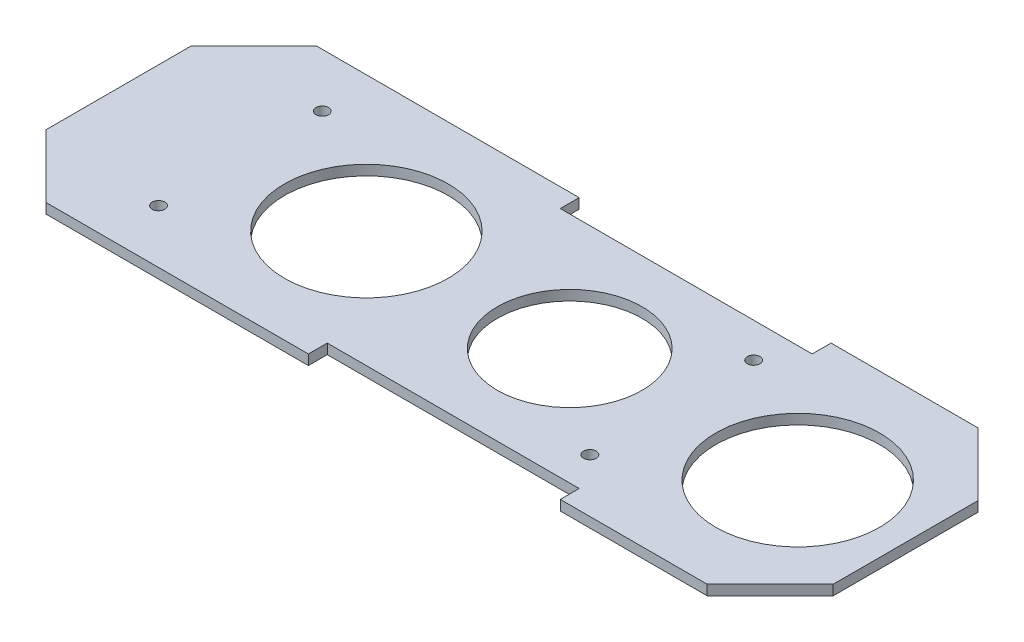
ISO-10303-21;
HEADER;
FILE_DESCRIPTION(('STEP AP214'),'2;1');
FILE_NAME('part.step','',(''),(''),'','','');
FILE_SCHEMA(('AUTOMOTIVE_DESIGN { 1 0 10303 214 1 1 1 1 }'));
ENDSEC;
DATA;
#1=APPLICATION_CONTEXT('core data for automotive mechanical design processes');
#2=APPLICATION_PROTOCOL_DEFINITION('international standard','automotive_design',2000,#1);
#3=PRODUCT_CONTEXT('',#1,'mechanical');
#4=PRODUCT('Part','Part','',(#3));
#5=PRODUCT_RELATED_PRODUCT_CATEGORY('part','',(#4));
#6=PRODUCT_DEFINITION_FORMATION('','',#4);
#7=PRODUCT_DEFINITION_CONTEXT('part definition',#1,'design');
#8=PRODUCT_DEFINITION('design','',#6,#7);
#9=PRODUCT_DEFINITION_SHAPE('','',#8);
#10=(LENGTH_UNIT() NAMED_UNIT(*) SI_UNIT(.MILLI.,.METRE.));
#11=(NAMED_UNIT(*) PLANE_ANGLE_UNIT() SI_UNIT($,.RADIAN.));
#12=(NAMED_UNIT(*) SI_UNIT($,.STERADIAN.) SOLID_ANGLE_UNIT());
#13=UNCERTAINTY_MEASURE_WITH_UNIT(LENGTH_MEASURE(1.E-05),#10,'distance_accuracy_value','');
#14=(GEOMETRIC_REPRESENTATION_CONTEXT(3) GLOBAL_UNCERTAINTY_ASSIGNED_CONTEXT((#13)) GLOBAL_UNIT_ASSIGNED_CONTEXT((#10,
#11,#12)) REPRESENTATION_CONTEXT('',''));
#15=CARTESIAN_POINT('',(0.,0.,0.));
#16=DIRECTION('',(0.,0.,1.));
#17=DIRECTION('',(1.,0.,0.));
#18=AXIS2_PLACEMENT_3D('',#15,#16,#17);
#19=CARTESIAN_POINT('',(91.6666666666666,1.6,0.));
#20=DIRECTION('',(-1.,0.,0.));
#21=DIRECTION('',(0.,0.,1.));
#22=AXIS2_PLACEMENT_3D('',#19,#20,#21);
#23=PLANE('',#22);
#24=DIRECTION('',(0.,0.,-1.));
#25=VECTOR('',#24,1.);
#26=CARTESIAN_POINT('',(91.6666666666666,0.,0.));
#27=LINE('',#26,#25);
#28=CARTESIAN_POINT('',(91.6666666666666,0.,21.5));
#29=VERTEX_POINT('',#28);
#30=CARTESIAN_POINT('',(91.6666666666666,0.,18.5));
#31=VERTEX_POINT('',#30);
#32=EDGE_CURVE('E162',#29,#31,#27,.T.);
#33=ORIENTED_EDGE('',*,*,#32,.F.);
#34=DIRECTION('',(0.,-1.,0.));
#35=VECTOR('',#34,1.);
#36=CARTESIAN_POINT('',(91.6666666666666,1.6,21.5));
#37=LINE('',#36,#35);
#38=CARTESIAN_POINT('',(91.6666666666666,1.6,21.5));
#39=VERTEX_POINT('',#38);
#40=EDGE_CURVE('E157',#39,#29,#37,.T.);
#41=ORIENTED_EDGE('',*,*,#40,.F.);
#42=DIRECTION('',(0.,0.,-1.));
#43=VECTOR('',#42,1.);
#44=CARTESIAN_POINT('',(91.6666666666666,1.6,0.));
#45=LINE('',#44,#43);
#46=CARTESIAN_POINT('',(91.6666666666666,1.6,18.5));
#47=VERTEX_POINT('',#46);
#48=EDGE_CURVE('E160',#39,#47,#45,.T.);
#49=ORIENTED_EDGE('',*,*,#48,.T.);
#50=DIRECTION('',(0.,-1.,0.));
#51=VECTOR('',#50,1.);
#52=CARTESIAN_POINT('',(91.6666666666666,1.6,18.5));
#53=LINE('',#52,#51);
#54=EDGE_CURVE('E230',#47,#31,#53,.T.);
#55=ORIENTED_EDGE('',*,*,#54,.T.);
#56=EDGE_LOOP('',(#33,#41,#49,#55));
#57=FACE_BOUND('',#56,.T.);
#58=ADVANCED_FACE('F42',(#57),#23,.T.);
#59=CARTESIAN_POINT('',(0.,1.6,21.5000000000002));
#60=DIRECTION('',(0.,0.,-1.));
#61=DIRECTION('',(-1.,0.,0.));
#62=AXIS2_PLACEMENT_3D('',#59,#60,#61);
#63=PLANE('',#62);
#64=DIRECTION('',(1.,0.,0.));
#65=VECTOR('',#64,1.);
#66=CARTESIAN_POINT('',(0.,0.,21.5000000000002));
#67=LINE('',#66,#65);
#68=CARTESIAN_POINT('',(115.,0.,21.4999999999999));
#69=VERTEX_POINT('',#68);
#70=EDGE_CURVE('E257',#29,#69,#67,.T.);
#71=ORIENTED_EDGE('',*,*,#70,.T.);
#72=DIRECTION('',(0.,1.,0.));
#73=VECTOR('',#72,1.);
#74=CARTESIAN_POINT('',(115.,1.6,21.4999999999999));
#75=LINE('',#74,#73);
#76=CARTESIAN_POINT('',(115.,1.6,21.4999999999999));
#77=VERTEX_POINT('',#76);
#78=EDGE_CURVE('E174',#69,#77,#75,.T.);
#79=ORIENTED_EDGE('',*,*,#78,.T.);
#80=DIRECTION('',(1.,0.,0.));
#81=VECTOR('',#80,1.);
#82=CARTESIAN_POINT('',(0.,1.6,21.5000000000002));
#83=LINE('',#82,#81);
#84=EDGE_CURVE('E171',#39,#77,#83,.T.);
#85=ORIENTED_EDGE('',*,*,#84,.F.);
#86=ORIENTED_EDGE('',*,*,#40,.T.);
#87=EDGE_LOOP('',(#71,#79,#85,#86));
#88=FACE_BOUND('',#87,.T.);
#89=ADVANCED_FACE('F172',(#88),#63,.F.);
#90=CARTESIAN_POINT('',(125.,1.6,0.));
#91=DIRECTION('',(1.,0.,0.));
#92=DIRECTION('',(0.,0.,-1.));
#93=AXIS2_PLACEMENT_3D('',#90,#91,#92);
#94=PLANE('',#93);
#95=DIRECTION('',(0.,0.,1.));
#96=VECTOR('',#95,1.);
#97=CARTESIAN_POINT('',(125.,0.,0.));
#98=LINE('',#97,#96);
#99=CARTESIAN_POINT('',(125.,0.,-11.4999999999999));
#100=VERTEX_POINT('',#99);
#101=CARTESIAN_POINT('',(125.,0.,11.4999999999999));
#102=VERTEX_POINT('',#101);
#103=EDGE_CURVE('E260',#100,#102,#98,.T.);
#104=ORIENTED_EDGE('',*,*,#103,.F.);
#105=DIRECTION('',(0.,1.,0.));
#106=VECTOR('',#105,1.);
#107=CARTESIAN_POINT('',(125.,1.6,-11.4999999999999));
#108=LINE('',#107,#106);
#109=CARTESIAN_POINT('',(125.,1.6,-11.4999999999999));
#110=VERTEX_POINT('',#109);
#111=EDGE_CURVE('E343',#100,#110,#108,.T.);
#112=ORIENTED_EDGE('',*,*,#111,.T.);
#113=DIRECTION('',(0.,0.,1.));
#114=VECTOR('',#113,1.);
#115=CARTESIAN_POINT('',(125.,1.6,0.));
#116=LINE('',#115,#114);
#117=CARTESIAN_POINT('',(125.,1.6,11.4999999999999));
#118=VERTEX_POINT('',#117);
#119=EDGE_CURVE('E177',#110,#118,#116,.T.);
#120=ORIENTED_EDGE('',*,*,#119,.T.);
#121=DIRECTION('',(0.,-1.,0.));
#122=VECTOR('',#121,1.);
#123=CARTESIAN_POINT('',(125.,0.,11.4999999999999));
#124=LINE('',#123,#122);
#125=EDGE_CURVE('E339',#118,#102,#124,.T.);
#126=ORIENTED_EDGE('',*,*,#125,.T.);
#127=EDGE_LOOP('',(#104,#112,#120,#126));
#128=FACE_BOUND('',#127,.T.);
#129=ADVANCED_FACE('F396',(#128),#94,.T.);
#130=CARTESIAN_POINT('',(0.,1.6,-21.5));
#131=DIRECTION('',(0.,0.,-1.));
#132=DIRECTION('',(-1.,0.,0.));
#133=AXIS2_PLACEMENT_3D('',#130,#131,#132);
#134=PLANE('',#133);
#135=DIRECTION('',(1.,0.,0.));
#136=VECTOR('',#135,1.);
#137=CARTESIAN_POINT('',(0.,1.6,-21.5));
#138=LINE('',#137,#136);
#139=CARTESIAN_POINT('',(91.6666666666666,1.6,-21.5));
#140=VERTEX_POINT('',#139);
#141=CARTESIAN_POINT('',(115.,1.6,-21.5));
#142=VERTEX_POINT('',#141);
#143=EDGE_CURVE('E197',#140,#142,#138,.T.);
#144=ORIENTED_EDGE('',*,*,#143,.T.);
#145=DIRECTION('',(0.,-1.,0.));
#146=VECTOR('',#145,1.);
#147=CARTESIAN_POINT('',(115.,1.6,-21.5));
#148=LINE('',#147,#146);
#149=CARTESIAN_POINT('',(115.,0.,-21.5));
#150=VERTEX_POINT('',#149);
#151=EDGE_CURVE('E167',#142,#150,#148,.T.);
#152=ORIENTED_EDGE('',*,*,#151,.T.);
#153=DIRECTION('',(1.,0.,0.));
#154=VECTOR('',#153,1.);
#155=CARTESIAN_POINT('',(0.,0.,-21.5));
#156=LINE('',#155,#154);
#157=CARTESIAN_POINT('',(91.6666666666666,0.,-21.5));
#158=VERTEX_POINT('',#157);
#159=EDGE_CURVE('E264',#158,#150,#156,.T.);
#160=ORIENTED_EDGE('',*,*,#159,.F.);
#161=DIRECTION('',(0.,-1.,0.));
#162=VECTOR('',#161,1.);
#163=CARTESIAN_POINT('',(91.6666666666666,1.6,-21.5));
#164=LINE('',#163,#162);
#165=EDGE_CURVE('E168',#140,#158,#164,.T.);
#166=ORIENTED_EDGE('',*,*,#165,.F.);
#167=EDGE_LOOP('',(#144,#152,#160,#166));
#168=FACE_BOUND('',#167,.T.);
#169=ADVANCED_FACE('F403',(#168),#134,.T.);
#170=CARTESIAN_POINT('',(91.6666666666666,1.6,0.));
#171=DIRECTION('',(1.,0.,0.));
#172=DIRECTION('',(0.,0.,-1.));
#173=AXIS2_PLACEMENT_3D('',#170,#171,#172);
#174=PLANE('',#173);
#175=DIRECTION('',(0.,0.,1.));
#176=VECTOR('',#175,1.);
#177=CARTESIAN_POINT('',(91.6666666666666,0.,0.));
#178=LINE('',#177,#176);
#179=CARTESIAN_POINT('',(91.6666666666666,0.,-18.5));
#180=VERTEX_POINT('',#179);
#181=EDGE_CURVE('E268',#158,#180,#178,.T.);
#182=ORIENTED_EDGE('',*,*,#181,.T.);
#183=DIRECTION('',(0.,-1.,0.));
#184=VECTOR('',#183,1.);
#185=CARTESIAN_POINT('',(91.6666666666666,1.6,-18.5));
#186=LINE('',#185,#184);
#187=CARTESIAN_POINT('',(91.6666666666666,1.6,-18.5));
#188=VERTEX_POINT('',#187);
#189=EDGE_CURVE('E319',#188,#180,#186,.T.);
#190=ORIENTED_EDGE('',*,*,#189,.F.);
#191=DIRECTION('',(0.,0.,1.));
#192=VECTOR('',#191,1.);
#193=CARTESIAN_POINT('',(91.6666666666666,1.6,0.));
#194=LINE('',#193,#192);
#195=EDGE_CURVE('E201',#140,#188,#194,.T.);
#196=ORIENTED_EDGE('',*,*,#195,.F.);
#197=ORIENTED_EDGE('',*,*,#165,.T.);
#198=EDGE_LOOP('',(#182,#190,#196,#197));
#199=FACE_BOUND('',#198,.T.);
#200=ADVANCED_FACE('F409',(#199),#174,.F.);
#201=CARTESIAN_POINT('',(0.,1.6,-18.5));
#202=DIRECTION('',(0.,0.,-1.));
#203=DIRECTION('',(-1.,0.,0.));
#204=AXIS2_PLACEMENT_3D('',#201,#202,#203);
#205=PLANE('',#204);
#206=DIRECTION('',(1.,0.,0.));
#207=VECTOR('',#206,1.);
#208=CARTESIAN_POINT('',(0.,0.,-18.5));
#209=LINE('',#208,#207);
#210=CARTESIAN_POINT('',(51.6666666666666,0.,-18.5));
#211=VERTEX_POINT('',#210);
#212=EDGE_CURVE('E272',#211,#180,#209,.T.);
#213=ORIENTED_EDGE('',*,*,#212,.F.);
#214=DIRECTION('',(0.,-1.,0.));
#215=VECTOR('',#214,1.);
#216=CARTESIAN_POINT('',(51.6666666666666,1.6,-18.5));
#217=LINE('',#216,#215);
#218=CARTESIAN_POINT('',(51.6666666666666,1.6,-18.5));
#219=VERTEX_POINT('',#218);
#220=EDGE_CURVE('E316',#219,#211,#217,.T.);
#221=ORIENTED_EDGE('',*,*,#220,.F.);
#222=DIRECTION('',(1.,0.,0.));
#223=VECTOR('',#222,1.);
#224=CARTESIAN_POINT('',(0.,1.6,-18.5));
#225=LINE('',#224,#223);
#226=EDGE_CURVE('E204',#219,#188,#225,.T.);
#227=ORIENTED_EDGE('',*,*,#226,.T.);
#228=ORIENTED_EDGE('',*,*,#189,.T.);
#229=EDGE_LOOP('',(#213,#221,#227,#228));
#230=FACE_BOUND('',#229,.T.);
#231=ADVANCED_FACE('F631',(#230),#205,.T.);
#232=CARTESIAN_POINT('',(51.6666666666666,1.6,0.));
#233=DIRECTION('',(1.,0.,0.));
#234=DIRECTION('',(0.,0.,-1.));
#235=AXIS2_PLACEMENT_3D('',#232,#233,#234);
#236=PLANE('',#235);
#237=DIRECTION('',(0.,0.,1.));
#238=VECTOR('',#237,1.);
#239=CARTESIAN_POINT('',(51.6666666666666,0.,0.));
#240=LINE('',#239,#238);
#241=CARTESIAN_POINT('',(51.6666666666666,0.,-21.5));
#242=VERTEX_POINT('',#241);
#243=EDGE_CURVE('E276',#242,#211,#240,.T.);
#244=ORIENTED_EDGE('',*,*,#243,.F.);
#245=DIRECTION('',(0.,-1.,0.));
#246=VECTOR('',#245,1.);
#247=CARTESIAN_POINT('',(51.6666666666666,1.6,-21.5));
#248=LINE('',#247,#246);
#249=CARTESIAN_POINT('',(51.6666666666666,1.6,-21.5));
#250=VERTEX_POINT('',#249);
#251=EDGE_CURVE('E312',#250,#242,#248,.T.);
#252=ORIENTED_EDGE('',*,*,#251,.F.);
#253=DIRECTION('',(0.,0.,1.));
#254=VECTOR('',#253,1.);
#255=CARTESIAN_POINT('',(51.6666666666666,1.6,0.));
#256=LINE('',#255,#254);
#257=EDGE_CURVE('E208',#250,#219,#256,.T.);
#258=ORIENTED_EDGE('',*,*,#257,.T.);
#259=ORIENTED_EDGE('',*,*,#220,.T.);
#260=EDGE_LOOP('',(#244,#252,#258,#259));
#261=FACE_BOUND('',#260,.T.);
#262=ADVANCED_FACE('F417',(#261),#236,.T.);
#263=CARTESIAN_POINT('',(0.,1.6,-21.5));
#264=DIRECTION('',(0.,0.,-1.));
#265=DIRECTION('',(-1.,0.,0.));
#266=AXIS2_PLACEMENT_3D('',#263,#264,#265);
#267=PLANE('',#266);
#268=DIRECTION('',(1.,0.,0.));
#269=VECTOR('',#268,1.);
#270=CARTESIAN_POINT('',(0.,0.,-21.5));
#271=LINE('',#270,#269);
#272=CARTESIAN_POINT('',(10.,0.,-21.5));
#273=VERTEX_POINT('',#272);
#274=EDGE_CURVE('E280',#273,#242,#271,.T.);
#275=ORIENTED_EDGE('',*,*,#274,.F.);
#276=DIRECTION('',(0.,1.,0.));
#277=VECTOR('',#276,1.);
#278=CARTESIAN_POINT('',(10.,1.6,-21.5));
#279=LINE('',#278,#277);
#280=CARTESIAN_POINT('',(10.,1.6,-21.5));
#281=VERTEX_POINT('',#280);
#282=EDGE_CURVE('E11',#273,#281,#279,.T.);
#283=ORIENTED_EDGE('',*,*,#282,.T.);
#284=DIRECTION('',(1.,0.,0.));
#285=VECTOR('',#284,1.);
#286=CARTESIAN_POINT('',(0.,1.6,-21.5));
#287=LINE('',#286,#285);
#288=EDGE_CURVE('E212',#281,#250,#287,.T.);
#289=ORIENTED_EDGE('',*,*,#288,.T.);
#290=ORIENTED_EDGE('',*,*,#251,.T.);
#291=EDGE_LOOP('',(#275,#283,#289,#290));
#292=FACE_BOUND('',#291,.T.);
#293=ADVANCED_FACE('F420',(#292),#267,.T.);
#294=CARTESIAN_POINT('',(0.,1.6,0.));
#295=DIRECTION('',(1.,0.,0.));
#296=DIRECTION('',(0.,0.,-1.));
#297=AXIS2_PLACEMENT_3D('',#294,#295,#296);
#298=PLANE('',#297);
#299=DIRECTION('',(0.,0.,1.));
#300=VECTOR('',#299,1.);
#301=CARTESIAN_POINT('',(0.,0.,0.));
#302=LINE('',#301,#300);
#303=CARTESIAN_POINT('',(0.,0.,-11.5));
#304=VERTEX_POINT('',#303);
#305=CARTESIAN_POINT('',(0.,0.,11.5));
#306=VERTEX_POINT('',#305);
#307=EDGE_CURVE('E283',#304,#306,#302,.T.);
#308=ORIENTED_EDGE('',*,*,#307,.T.);
#309=DIRECTION('',(0.,1.,0.));
#310=VECTOR('',#309,1.);
#311=CARTESIAN_POINT('',(0.,1.6,11.5));
#312=LINE('',#311,#310);
#313=CARTESIAN_POINT('',(0.,1.6,11.5));
#314=VERTEX_POINT('',#313);
#315=EDGE_CURVE('E52',#306,#314,#312,.T.);
#316=ORIENTED_EDGE('',*,*,#315,.T.);
#317=DIRECTION('',(0.,0.,1.));
#318=VECTOR('',#317,1.);
#319=CARTESIAN_POINT('',(0.,1.6,0.));
#320=LINE('',#319,#318);
#321=CARTESIAN_POINT('',(0.,1.6,-11.5));
#322=VERTEX_POINT('',#321);
#323=EDGE_CURVE('E215',#322,#314,#320,.T.);
#324=ORIENTED_EDGE('',*,*,#323,.F.);
#325=DIRECTION('',(0.,-1.,0.));
#326=VECTOR('',#325,1.);
#327=CARTESIAN_POINT('',(0.,0.,-11.5));
#328=LINE('',#327,#326);
#329=EDGE_CURVE('E363',#322,#304,#328,.T.);
#330=ORIENTED_EDGE('',*,*,#329,.T.);
#331=EDGE_LOOP('',(#308,#316,#324,#330));
#332=FACE_BOUND('',#331,.T.);
#333=ADVANCED_FACE('F369',(#332),#298,.F.);
#334=CARTESIAN_POINT('',(0.,1.6,21.5));
#335=DIRECTION('',(0.,0.,-1.));
#336=DIRECTION('',(-1.,0.,0.));
#337=AXIS2_PLACEMENT_3D('',#334,#335,#336);
#338=PLANE('',#337);
#339=DIRECTION('',(1.,0.,0.));
#340=VECTOR('',#339,1.);
#341=CARTESIAN_POINT('',(0.,1.6,21.5));
#342=LINE('',#341,#340);
#343=CARTESIAN_POINT('',(10.,1.6,21.5));
#344=VERTEX_POINT('',#343);
#345=CARTESIAN_POINT('',(51.6666666666666,1.6,21.5));
#346=VERTEX_POINT('',#345);
#347=EDGE_CURVE('E218',#344,#346,#342,.T.);
#348=ORIENTED_EDGE('',*,*,#347,.F.);
#349=DIRECTION('',(0.,-1.,0.));
#350=VECTOR('',#349,1.);
#351=CARTESIAN_POINT('',(10.,1.6,21.5));
#352=LINE('',#351,#350);
#353=CARTESIAN_POINT('',(10.,0.,21.5));
#354=VERTEX_POINT('',#353);
#355=EDGE_CURVE('E359',#344,#354,#352,.T.);
#356=ORIENTED_EDGE('',*,*,#355,.T.);
#357=DIRECTION('',(1.,0.,0.));
#358=VECTOR('',#357,1.);
#359=CARTESIAN_POINT('',(0.,0.,21.5));
#360=LINE('',#359,#358);
#361=CARTESIAN_POINT('',(51.6666666666666,0.,21.5));
#362=VERTEX_POINT('',#361);
#363=EDGE_CURVE('E286',#354,#362,#360,.T.);
#364=ORIENTED_EDGE('',*,*,#363,.T.);
#365=DIRECTION('',(0.,-1.,0.));
#366=VECTOR('',#365,1.);
#367=CARTESIAN_POINT('',(51.6666666666666,1.6,21.5));
#368=LINE('',#367,#366);
#369=EDGE_CURVE('E308',#346,#362,#368,.T.);
#370=ORIENTED_EDGE('',*,*,#369,.F.);
#371=EDGE_LOOP('',(#348,#356,#364,#370));
#372=FACE_BOUND('',#371,.T.);
#373=ADVANCED_FACE('F382',(#372),#338,.F.);
#374=CARTESIAN_POINT('',(51.6666666666666,1.6,0.));
#375=DIRECTION('',(-1.,0.,0.));
#376=DIRECTION('',(0.,0.,1.));
#377=AXIS2_PLACEMENT_3D('',#374,#375,#376);
#378=PLANE('',#377);
#379=DIRECTION('',(0.,0.,-1.));
#380=VECTOR('',#379,1.);
#381=CARTESIAN_POINT('',(51.6666666666666,0.,0.));
#382=LINE('',#381,#380);
#383=CARTESIAN_POINT('',(51.6666666666666,0.,18.5));
#384=VERTEX_POINT('',#383);
#385=EDGE_CURVE('E289',#362,#384,#382,.T.);
#386=ORIENTED_EDGE('',*,*,#385,.T.);
#387=DIRECTION('',(0.,-1.,0.));
#388=VECTOR('',#387,1.);
#389=CARTESIAN_POINT('',(51.6666666666666,1.6,18.5));
#390=LINE('',#389,#388);
#391=CARTESIAN_POINT('',(51.6666666666666,1.6,18.5));
#392=VERTEX_POINT('',#391);
#393=EDGE_CURVE('E304',#392,#384,#390,.T.);
#394=ORIENTED_EDGE('',*,*,#393,.F.);
#395=DIRECTION('',(0.,0.,-1.));
#396=VECTOR('',#395,1.);
#397=CARTESIAN_POINT('',(51.6666666666666,1.6,0.));
#398=LINE('',#397,#396);
#399=EDGE_CURVE('E221',#346,#392,#398,.T.);
#400=ORIENTED_EDGE('',*,*,#399,.F.);
#401=ORIENTED_EDGE('',*,*,#369,.T.);
#402=EDGE_LOOP('',(#386,#394,#400,#401));
#403=FACE_BOUND('',#402,.T.);
#404=ADVANCED_FACE('F387',(#403),#378,.F.);
#405=CARTESIAN_POINT('',(0.,1.6,18.5));
#406=DIRECTION('',(0.,0.,-1.));
#407=DIRECTION('',(-1.,0.,0.));
#408=AXIS2_PLACEMENT_3D('',#405,#406,#407);
#409=PLANE('',#408);
#410=DIRECTION('',(1.,0.,0.));
#411=VECTOR('',#410,1.);
#412=CARTESIAN_POINT('',(0.,0.,18.5));
#413=LINE('',#412,#411);
#414=EDGE_CURVE('E293',#384,#31,#413,.T.);
#415=ORIENTED_EDGE('',*,*,#414,.T.);
#416=ORIENTED_EDGE('',*,*,#54,.F.);
#417=DIRECTION('',(1.,0.,0.));
#418=VECTOR('',#417,1.);
#419=CARTESIAN_POINT('',(0.,1.6,18.5));
#420=LINE('',#419,#418);
#421=EDGE_CURVE('E183',#392,#47,#420,.T.);
#422=ORIENTED_EDGE('',*,*,#421,.F.);
#423=ORIENTED_EDGE('',*,*,#393,.T.);
#424=EDGE_LOOP('',(#415,#416,#422,#423));
#425=FACE_BOUND('',#424,.T.);
#426=ADVANCED_FACE('F389',(#425),#409,.F.);
#427=CARTESIAN_POINT('',(19.37,1.6,-13.));
#428=DIRECTION('',(0.,-1.,0.));
#429=DIRECTION('',(0.,0.,-1.));
#430=AXIS2_PLACEMENT_3D('',#427,#428,#429);
#431=CYLINDRICAL_SURFACE('',#430,1.);
#432=CARTESIAN_POINT('',(19.37,1.6,-13.));
#433=DIRECTION('',(0.,1.,0.));
#434=DIRECTION('',(0.,0.,1.));
#435=AXIS2_PLACEMENT_3D('',#432,#433,#434);
#436=CIRCLE('',#435,1.);
#437=CARTESIAN_POINT('',(19.37,1.6,-12.));
#438=VERTEX_POINT('',#437);
#439=EDGE_CURVE('E186',#438,#438,#436,.T.);
#440=ORIENTED_EDGE('',*,*,#439,.T.);
#441=EDGE_LOOP('',(#440));
#442=FACE_BOUND('',#441,.T.);
#443=CARTESIAN_POINT('',(19.37,0.,-13.));
#444=DIRECTION('',(0.,1.,0.));
#445=DIRECTION('',(0.,0.,1.));
#446=AXIS2_PLACEMENT_3D('',#443,#444,#445);
#447=CIRCLE('',#446,1.);
#448=CARTESIAN_POINT('',(19.37,0.,-12.));
#449=VERTEX_POINT('',#448);
#450=EDGE_CURVE('E251',#449,#449,#447,.T.);
#451=ORIENTED_EDGE('',*,*,#450,.F.);
#452=EDGE_LOOP('',(#451));
#453=FACE_BOUND('',#452,.T.);
#454=ADVANCED_FACE('F434',(#442,#453),#431,.F.);
#455=CARTESIAN_POINT('',(87.87,1.6,-13.));
#456=DIRECTION('',(0.,-1.,0.));
#457=DIRECTION('',(0.,0.,-1.));
#458=AXIS2_PLACEMENT_3D('',#455,#456,#457);
#459=CYLINDRICAL_SURFACE('',#458,0.999999999999998);
#460=CARTESIAN_POINT('',(87.87,1.6,-13.));
#461=DIRECTION('',(0.,1.,0.));
#462=DIRECTION('',(0.,0.,1.));
#463=AXIS2_PLACEMENT_3D('',#460,#461,#462);
#464=CIRCLE('',#463,0.999999999999998);
#465=CARTESIAN_POINT('',(87.87,1.6,-12.));
#466=VERTEX_POINT('',#465);
#467=EDGE_CURVE('E190',#466,#466,#464,.T.);
#468=ORIENTED_EDGE('',*,*,#467,.T.);
#469=EDGE_LOOP('',(#468));
#470=FACE_BOUND('',#469,.T.);
#471=CARTESIAN_POINT('',(87.87,0.,-13.));
#472=DIRECTION('',(0.,1.,0.));
#473=DIRECTION('',(0.,0.,1.));
#474=AXIS2_PLACEMENT_3D('',#471,#472,#473);
#475=CIRCLE('',#474,0.999999999999998);
#476=CARTESIAN_POINT('',(87.87,0.,-12.));
#477=VERTEX_POINT('',#476);
#478=EDGE_CURVE('E247',#477,#477,#475,.T.);
#479=ORIENTED_EDGE('',*,*,#478,.F.);
#480=EDGE_LOOP('',(#479));
#481=FACE_BOUND('',#480,.T.);
#482=ADVANCED_FACE('F437',(#470,#481),#459,.F.);
#483=CARTESIAN_POINT('',(87.87,1.6,13.));
#484=DIRECTION('',(0.,-1.,0.));
#485=DIRECTION('',(0.,0.,-1.));
#486=AXIS2_PLACEMENT_3D('',#483,#484,#485);
#487=CYLINDRICAL_SURFACE('',#486,0.999999999999998);
#488=CARTESIAN_POINT('',(87.87,1.6,13.));
#489=DIRECTION('',(0.,1.,0.));
#490=DIRECTION('',(0.,0.,1.));
#491=AXIS2_PLACEMENT_3D('',#488,#489,#490);
#492=CIRCLE('',#491,0.999999999999998);
#493=CARTESIAN_POINT('',(87.87,1.6,14.));
#494=VERTEX_POINT('',#493);
#495=EDGE_CURVE('E671',#494,#494,#492,.F.);
#496=ORIENTED_EDGE('',*,*,#495,.F.);
#497=EDGE_LOOP('',(#496));
#498=FACE_BOUND('',#497,.T.);
#499=CARTESIAN_POINT('',(87.87,0.,13.));
#500=DIRECTION('',(0.,1.,0.));
#501=DIRECTION('',(0.,0.,1.));
#502=AXIS2_PLACEMENT_3D('',#499,#500,#501);
#503=CIRCLE('',#502,0.999999999999998);
#504=CARTESIAN_POINT('',(87.87,0.,14.));
#505=VERTEX_POINT('',#504);
#506=EDGE_CURVE('E243',#505,#505,#503,.F.);
#507=ORIENTED_EDGE('',*,*,#506,.T.);
#508=EDGE_LOOP('',(#507));
#509=FACE_BOUND('',#508,.T.);
#510=ADVANCED_FACE('F441',(#498,#509),#487,.F.);
#511=CARTESIAN_POINT('',(39.37,1.6,0.));
#512=DIRECTION('',(0.,-1.,0.));
#513=DIRECTION('',(0.,0.,-1.));
#514=AXIS2_PLACEMENT_3D('',#511,#512,#513);
#515=CYLINDRICAL_SURFACE('',#514,13.);
#516=CARTESIAN_POINT('',(39.37,1.6,0.));
#517=DIRECTION('',(0.,1.,0.));
#518=DIRECTION('',(0.,0.,1.));
#519=AXIS2_PLACEMENT_3D('',#516,#517,#518);
#520=CIRCLE('',#519,13.);
#521=CARTESIAN_POINT('',(39.37,1.6,13.));
#522=VERTEX_POINT('',#521);
#523=EDGE_CURVE('E667',#522,#522,#520,.T.);
#524=ORIENTED_EDGE('',*,*,#523,.T.);
#525=EDGE_LOOP('',(#524));
#526=FACE_BOUND('',#525,.T.);
#527=CARTESIAN_POINT('',(39.37,0.,0.));
#528=DIRECTION('',(0.,1.,0.));
#529=DIRECTION('',(0.,0.,1.));
#530=AXIS2_PLACEMENT_3D('',#527,#528,#529);
#531=CIRCLE('',#530,13.);
#532=CARTESIAN_POINT('',(39.37,0.,13.));
#533=VERTEX_POINT('',#532);
#534=EDGE_CURVE('E239',#533,#533,#531,.T.);
#535=ORIENTED_EDGE('',*,*,#534,.F.);
#536=EDGE_LOOP('',(#535));
#537=FACE_BOUND('',#536,.T.);
#538=ADVANCED_FACE('F445',(#526,#537),#515,.F.);
#539=CARTESIAN_POINT('',(107.87,1.6,0.));
#540=DIRECTION('',(0.,-1.,0.));
#541=DIRECTION('',(0.,0.,-1.));
#542=AXIS2_PLACEMENT_3D('',#539,#540,#541);
#543=CYLINDRICAL_SURFACE('',#542,13.);
#544=CARTESIAN_POINT('',(107.87,1.6,0.));
#545=DIRECTION('',(0.,1.,0.));
#546=DIRECTION('',(0.,0.,1.));
#547=AXIS2_PLACEMENT_3D('',#544,#545,#546);
#548=CIRCLE('',#547,13.);
#549=CARTESIAN_POINT('',(107.87,1.6,13.));
#550=VERTEX_POINT('',#549);
#551=EDGE_CURVE('E663',#550,#550,#548,.T.);
#552=ORIENTED_EDGE('',*,*,#551,.T.);
#553=EDGE_LOOP('',(#552));
#554=FACE_BOUND('',#553,.T.);
#555=CARTESIAN_POINT('',(107.87,0.,0.));
#556=DIRECTION('',(0.,1.,0.));
#557=DIRECTION('',(0.,0.,1.));
#558=AXIS2_PLACEMENT_3D('',#555,#556,#557);
#559=CIRCLE('',#558,13.);
#560=CARTESIAN_POINT('',(107.87,0.,13.));
#561=VERTEX_POINT('',#560);
#562=EDGE_CURVE('E235',#561,#561,#559,.T.);
#563=ORIENTED_EDGE('',*,*,#562,.F.);
#564=EDGE_LOOP('',(#563));
#565=FACE_BOUND('',#564,.T.);
#566=ADVANCED_FACE('F449',(#554,#565),#543,.F.);
#567=CARTESIAN_POINT('',(71.6666666666666,1.6,0.));
#568=DIRECTION('',(0.,-1.,0.));
#569=DIRECTION('',(0.,0.,-1.));
#570=AXIS2_PLACEMENT_3D('',#567,#568,#569);
#571=CYLINDRICAL_SURFACE('',#570,11.5);
#572=CARTESIAN_POINT('',(71.6666666666666,1.6,0.));
#573=DIRECTION('',(0.,1.,0.));
#574=DIRECTION('',(0.,0.,1.));
#575=AXIS2_PLACEMENT_3D('',#572,#573,#574);
#576=CIRCLE('',#575,11.5);
#577=CARTESIAN_POINT('',(71.6666666666666,1.6,11.5));
#578=VERTEX_POINT('',#577);
#579=EDGE_CURVE('E301',#578,#578,#576,.T.);
#580=ORIENTED_EDGE('',*,*,#579,.T.);
#581=EDGE_LOOP('',(#580));
#582=FACE_BOUND('',#581,.T.);
#583=CARTESIAN_POINT('',(71.6666666666666,0.,0.));
#584=DIRECTION('',(0.,1.,0.));
#585=DIRECTION('',(0.,0.,1.));
#586=AXIS2_PLACEMENT_3D('',#583,#584,#585);
#587=CIRCLE('',#586,11.5);
#588=CARTESIAN_POINT('',(71.6666666666666,0.,11.5));
#589=VERTEX_POINT('',#588);
#590=EDGE_CURVE('E231',#589,#589,#587,.T.);
#591=ORIENTED_EDGE('',*,*,#590,.F.);
#592=EDGE_LOOP('',(#591));
#593=FACE_BOUND('',#592,.T.);
#594=ADVANCED_FACE('F453',(#582,#593),#571,.F.);
#595=CARTESIAN_POINT('',(19.37,1.6,13.));
#596=DIRECTION('',(0.,-1.,0.));
#597=DIRECTION('',(0.,0.,-1.));
#598=AXIS2_PLACEMENT_3D('',#595,#596,#597);
#599=CYLINDRICAL_SURFACE('',#598,1.);
#600=CARTESIAN_POINT('',(19.37,1.6,13.));
#601=DIRECTION('',(0.,1.,0.));
#602=DIRECTION('',(0.,0.,1.));
#603=AXIS2_PLACEMENT_3D('',#600,#601,#602);
#604=CIRCLE('',#603,1.);
#605=CARTESIAN_POINT('',(19.37,1.6,14.));
#606=VERTEX_POINT('',#605);
#607=EDGE_CURVE('E226',#606,#606,#604,.F.);
#608=ORIENTED_EDGE('',*,*,#607,.F.);
#609=EDGE_LOOP('',(#608));
#610=FACE_BOUND('',#609,.T.);
#611=CARTESIAN_POINT('',(19.37,0.,13.));
#612=DIRECTION('',(0.,1.,0.));
#613=DIRECTION('',(0.,0.,1.));
#614=AXIS2_PLACEMENT_3D('',#611,#612,#613);
#615=CIRCLE('',#614,1.);
#616=CARTESIAN_POINT('',(19.37,0.,14.));
#617=VERTEX_POINT('',#616);
#618=EDGE_CURVE('E297',#617,#617,#615,.F.);
#619=ORIENTED_EDGE('',*,*,#618,.T.);
#620=EDGE_LOOP('',(#619));
#621=FACE_BOUND('',#620,.T.);
#622=ADVANCED_FACE('F457',(#610,#621),#599,.F.);
#623=CARTESIAN_POINT('',(0.,1.6,0.));
#624=DIRECTION('',(0.,1.,0.));
#625=DIRECTION('',(0.,0.,1.));
#626=AXIS2_PLACEMENT_3D('',#623,#624,#625);
#627=PLANE('',#626);
#628=ORIENTED_EDGE('',*,*,#579,.F.);
#629=EDGE_LOOP('',(#628));
#630=FACE_BOUND('',#629,.T.);
#631=ORIENTED_EDGE('',*,*,#551,.F.);
#632=EDGE_LOOP('',(#631));
#633=FACE_BOUND('',#632,.T.);
#634=ORIENTED_EDGE('',*,*,#523,.F.);
#635=EDGE_LOOP('',(#634));
#636=FACE_BOUND('',#635,.T.);
#637=ORIENTED_EDGE('',*,*,#495,.T.);
#638=EDGE_LOOP('',(#637));
#639=FACE_BOUND('',#638,.T.);
#640=ORIENTED_EDGE('',*,*,#467,.F.);
#641=EDGE_LOOP('',(#640));
#642=FACE_BOUND('',#641,.T.);
#643=ORIENTED_EDGE('',*,*,#439,.F.);
#644=EDGE_LOOP('',(#643));
#645=FACE_BOUND('',#644,.T.);
#646=ORIENTED_EDGE('',*,*,#119,.F.);
#647=DIRECTION('',(0.707106781186546,0.,0.707106781186549));
#648=VECTOR('',#647,1.);
#649=CARTESIAN_POINT('',(68.2500000000002,1.6,-68.2499999999999));
#650=LINE('',#649,#648);
#651=EDGE_CURVE('E354',#110,#142,#650,.F.);
#652=ORIENTED_EDGE('',*,*,#651,.T.);
#653=ORIENTED_EDGE('',*,*,#143,.F.);
#654=ORIENTED_EDGE('',*,*,#195,.T.);
#655=ORIENTED_EDGE('',*,*,#226,.F.);
#656=ORIENTED_EDGE('',*,*,#257,.F.);
#657=ORIENTED_EDGE('',*,*,#288,.F.);
#658=DIRECTION('',(-0.707106781186549,0.,0.707106781186547));
#659=VECTOR('',#658,1.);
#660=CARTESIAN_POINT('',(-5.75,1.6,-5.75000000000001));
#661=LINE('',#660,#659);
#662=EDGE_CURVE('E346',#281,#322,#661,.T.);
#663=ORIENTED_EDGE('',*,*,#662,.T.);
#664=ORIENTED_EDGE('',*,*,#323,.T.);
#665=DIRECTION('',(-0.707106781186547,0.,-0.707106781186549));
#666=VECTOR('',#665,1.);
#667=CARTESIAN_POINT('',(-5.74999999999998,1.6,5.74999999999996));
#668=LINE('',#667,#666);
#669=EDGE_CURVE('E59',#314,#344,#668,.F.);
#670=ORIENTED_EDGE('',*,*,#669,.T.);
#671=ORIENTED_EDGE('',*,*,#347,.T.);
#672=ORIENTED_EDGE('',*,*,#399,.T.);
#673=ORIENTED_EDGE('',*,*,#421,.T.);
#674=ORIENTED_EDGE('',*,*,#48,.F.);
#675=ORIENTED_EDGE('',*,*,#84,.T.);
#676=DIRECTION('',(0.707106781186548,0.,-0.707106781186548));
#677=VECTOR('',#676,1.);
#678=CARTESIAN_POINT('',(68.2499999999999,1.6,68.2499999999999));
#679=LINE('',#678,#677);
#680=EDGE_CURVE('E351',#77,#118,#679,.T.);
#681=ORIENTED_EDGE('',*,*,#680,.T.);
#682=EDGE_LOOP('',(#646,#652,#653,#654,#655,#656,#657,#663,#664,#670,#671,#672,#673,#674,#675,#681));
#683=FACE_BOUND('',#682,.T.);
#684=ORIENTED_EDGE('',*,*,#607,.T.);
#685=EDGE_LOOP('',(#684));
#686=FACE_BOUND('',#685,.T.);
#687=ADVANCED_FACE('F180',(#630,#633,#636,#639,#642,#645,#683,#686),#627,.T.);
#688=CARTESIAN_POINT('',(0.,0.,0.));
#689=DIRECTION('',(0.,1.,0.));
#690=DIRECTION('',(0.,0.,1.));
#691=AXIS2_PLACEMENT_3D('',#688,#689,#690);
#692=PLANE('',#691);
#693=ORIENTED_EDGE('',*,*,#590,.T.);
#694=EDGE_LOOP('',(#693));
#695=FACE_BOUND('',#694,.T.);
#696=ORIENTED_EDGE('',*,*,#562,.T.);
#697=EDGE_LOOP('',(#696));
#698=FACE_BOUND('',#697,.T.);
#699=ORIENTED_EDGE('',*,*,#534,.T.);
#700=EDGE_LOOP('',(#699));
#701=FACE_BOUND('',#700,.T.);
#702=ORIENTED_EDGE('',*,*,#506,.F.);
#703=EDGE_LOOP('',(#702));
#704=FACE_BOUND('',#703,.T.);
#705=ORIENTED_EDGE('',*,*,#478,.T.);
#706=EDGE_LOOP('',(#705));
#707=FACE_BOUND('',#706,.T.);
#708=ORIENTED_EDGE('',*,*,#450,.T.);
#709=EDGE_LOOP('',(#708));
#710=FACE_BOUND('',#709,.T.);
#711=ORIENTED_EDGE('',*,*,#159,.T.);
#712=DIRECTION('',(-0.707106781186546,0.,-0.707106781186549));
#713=VECTOR('',#712,1.);
#714=CARTESIAN_POINT('',(115.,0.,-21.5));
#715=LINE('',#714,#713);
#716=EDGE_CURVE('E336',#150,#100,#715,.F.);
#717=ORIENTED_EDGE('',*,*,#716,.T.);
#718=ORIENTED_EDGE('',*,*,#103,.T.);
#719=DIRECTION('',(-0.707106781186548,0.,0.707106781186548));
#720=VECTOR('',#719,1.);
#721=CARTESIAN_POINT('',(125.,0.,11.4999999999999));
#722=LINE('',#721,#720);
#723=EDGE_CURVE('E333',#102,#69,#722,.T.);
#724=ORIENTED_EDGE('',*,*,#723,.T.);
#725=ORIENTED_EDGE('',*,*,#70,.F.);
#726=ORIENTED_EDGE('',*,*,#32,.T.);
#727=ORIENTED_EDGE('',*,*,#414,.F.);
#728=ORIENTED_EDGE('',*,*,#385,.F.);
#729=ORIENTED_EDGE('',*,*,#363,.F.);
#730=DIRECTION('',(0.707106781186547,0.,0.707106781186549));
#731=VECTOR('',#730,1.);
#732=CARTESIAN_POINT('',(10.,0.,21.5));
#733=LINE('',#732,#731);
#734=EDGE_CURVE('E330',#354,#306,#733,.F.);
#735=ORIENTED_EDGE('',*,*,#734,.T.);
#736=ORIENTED_EDGE('',*,*,#307,.F.);
#737=DIRECTION('',(0.707106781186549,0.,-0.707106781186547));
#738=VECTOR('',#737,1.);
#739=CARTESIAN_POINT('',(0.,0.,-11.5));
#740=LINE('',#739,#738);
#741=EDGE_CURVE('E327',#304,#273,#740,.T.);
#742=ORIENTED_EDGE('',*,*,#741,.T.);
#743=ORIENTED_EDGE('',*,*,#274,.T.);
#744=ORIENTED_EDGE('',*,*,#243,.T.);
#745=ORIENTED_EDGE('',*,*,#212,.T.);
#746=ORIENTED_EDGE('',*,*,#181,.F.);
#747=EDGE_LOOP('',(#711,#717,#718,#724,#725,#726,#727,#728,#729,#735,#736,#742,#743,#744,#745,#746));
#748=FACE_BOUND('',#747,.T.);
#749=ORIENTED_EDGE('',*,*,#618,.F.);
#750=EDGE_LOOP('',(#749));
#751=FACE_BOUND('',#750,.T.);
#752=ADVANCED_FACE('F373',(#695,#698,#701,#704,#707,#710,#748,#751),#692,.F.);
#753=CARTESIAN_POINT('',(115.,1.6,-21.5));
#754=DIRECTION('',(-0.707106781186549,0.,0.707106781186546));
#755=DIRECTION('',(0.,-1.,0.));
#756=AXIS2_PLACEMENT_3D('',#753,#754,#755);
#757=PLANE('',#756);
#758=ORIENTED_EDGE('',*,*,#651,.F.);
#759=ORIENTED_EDGE('',*,*,#111,.F.);
#760=ORIENTED_EDGE('',*,*,#716,.F.);
#761=ORIENTED_EDGE('',*,*,#151,.F.);
#762=EDGE_LOOP('',(#758,#759,#760,#761));
#763=FACE_BOUND('',#762,.T.);
#764=ADVANCED_FACE('F399',(#763),#757,.F.);
#765=CARTESIAN_POINT('',(125.,1.6,11.4999999999999));
#766=DIRECTION('',(0.707106781186548,0.,0.707106781186548));
#767=DIRECTION('',(0.,1.,0.));
#768=AXIS2_PLACEMENT_3D('',#765,#766,#767);
#769=PLANE('',#768);
#770=ORIENTED_EDGE('',*,*,#680,.F.);
#771=ORIENTED_EDGE('',*,*,#78,.F.);
#772=ORIENTED_EDGE('',*,*,#723,.F.);
#773=ORIENTED_EDGE('',*,*,#125,.F.);
#774=EDGE_LOOP('',(#770,#771,#772,#773));
#775=FACE_BOUND('',#774,.T.);
#776=ADVANCED_FACE('F391',(#775),#769,.T.);
#777=CARTESIAN_POINT('',(10.,1.6,21.5));
#778=DIRECTION('',(0.707106781186549,0.,-0.707106781186547));
#779=DIRECTION('',(0.,-1.,0.));
#780=AXIS2_PLACEMENT_3D('',#777,#778,#779);
#781=PLANE('',#780);
#782=ORIENTED_EDGE('',*,*,#669,.F.);
#783=ORIENTED_EDGE('',*,*,#315,.F.);
#784=ORIENTED_EDGE('',*,*,#734,.F.);
#785=ORIENTED_EDGE('',*,*,#355,.F.);
#786=EDGE_LOOP('',(#782,#783,#784,#785));
#787=FACE_BOUND('',#786,.T.);
#788=ADVANCED_FACE('F380',(#787),#781,.F.);
#789=CARTESIAN_POINT('',(0.,1.6,-11.5));
#790=DIRECTION('',(-0.707106781186547,0.,-0.707106781186549));
#791=DIRECTION('',(0.,1.,0.));
#792=AXIS2_PLACEMENT_3D('',#789,#790,#791);
#793=PLANE('',#792);
#794=ORIENTED_EDGE('',*,*,#662,.F.);
#795=ORIENTED_EDGE('',*,*,#282,.F.);
#796=ORIENTED_EDGE('',*,*,#741,.F.);
#797=ORIENTED_EDGE('',*,*,#329,.F.);
#798=EDGE_LOOP('',(#794,#795,#796,#797));
#799=FACE_BOUND('',#798,.T.);
#800=ADVANCED_FACE('F45',(#799),#793,.T.);
#801=CLOSED_SHELL('',(#58,#89,#129,#169,#200,#231,#262,#293,#333,#373,#404,#426,#454,#482,#510,
#538,#566,#594,#622,#687,#752,#764,#776,#788,#800));
#802=MANIFOLD_SOLID_BREP('B2',#801);
#803=ADVANCED_BREP_SHAPE_REPRESENTATION('',(#18,#802),#14);
#804=SHAPE_DEFINITION_REPRESENTATION(#9,#803);
ENDSEC;
END-ISO-10303-21;
